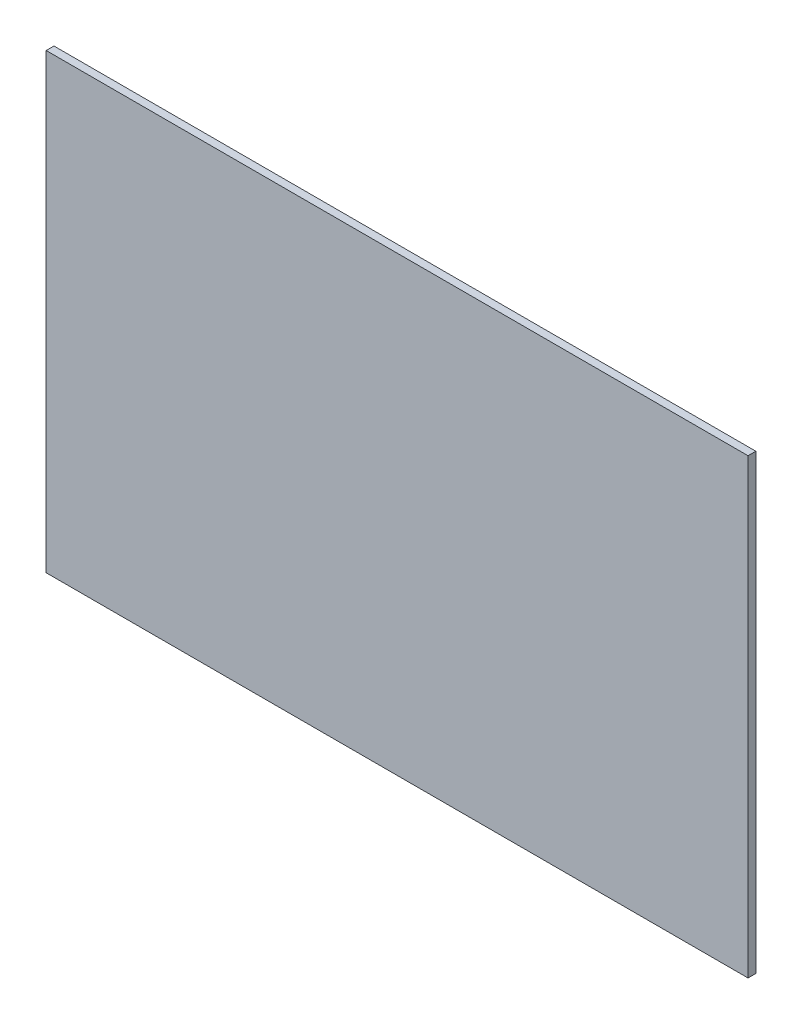
ISO-10303-21;
HEADER;
FILE_DESCRIPTION(('STEP AP214'),'2;1');
FILE_NAME('part.step','',(''),(''),'','','');
FILE_SCHEMA(('AUTOMOTIVE_DESIGN { 1 0 10303 214 1 1 1 1 }'));
ENDSEC;
DATA;
#1=APPLICATION_CONTEXT('core data for automotive mechanical design processes');
#2=APPLICATION_PROTOCOL_DEFINITION('international standard','automotive_design',2000,#1);
#3=PRODUCT_CONTEXT('',#1,'mechanical');
#4=PRODUCT('Part','Part','',(#3));
#5=PRODUCT_RELATED_PRODUCT_CATEGORY('part','',(#4));
#6=PRODUCT_DEFINITION_FORMATION('','',#4);
#7=PRODUCT_DEFINITION_CONTEXT('part definition',#1,'design');
#8=PRODUCT_DEFINITION('design','',#6,#7);
#9=PRODUCT_DEFINITION_SHAPE('','',#8);
#10=(LENGTH_UNIT() NAMED_UNIT(*) SI_UNIT(.MILLI.,.METRE.));
#11=(NAMED_UNIT(*) PLANE_ANGLE_UNIT() SI_UNIT($,.RADIAN.));
#12=(NAMED_UNIT(*) SI_UNIT($,.STERADIAN.) SOLID_ANGLE_UNIT());
#13=UNCERTAINTY_MEASURE_WITH_UNIT(LENGTH_MEASURE(1.E-05),#10,'distance_accuracy_value','');
#14=(GEOMETRIC_REPRESENTATION_CONTEXT(3) GLOBAL_UNCERTAINTY_ASSIGNED_CONTEXT((#13)) GLOBAL_UNIT_ASSIGNED_CONTEXT((#10,
#11,#12)) REPRESENTATION_CONTEXT('',''));
#15=CARTESIAN_POINT('',(0.,0.,0.));
#16=DIRECTION('',(0.,0.,1.));
#17=DIRECTION('',(1.,0.,0.));
#18=AXIS2_PLACEMENT_3D('',#15,#16,#17);
#19=CARTESIAN_POINT('',(285.75,184.15,6.35));
#20=DIRECTION('',(-1.,0.,0.));
#21=DIRECTION('',(0.,-1.,0.));
#22=AXIS2_PLACEMENT_3D('',#19,#20,#21);
#23=PLANE('',#22);
#24=DIRECTION('',(0.,1.,0.));
#25=VECTOR('',#24,1.);
#26=CARTESIAN_POINT('',(285.75,184.15,0.));
#27=LINE('',#26,#25);
#28=CARTESIAN_POINT('',(285.75,-184.15,0.));
#29=VERTEX_POINT('',#28);
#30=CARTESIAN_POINT('',(285.75,184.15,0.));
#31=VERTEX_POINT('',#30);
#32=EDGE_CURVE('E96',#29,#31,#27,.T.);
#33=ORIENTED_EDGE('',*,*,#32,.T.);
#34=DIRECTION('',(0.,0.,-1.));
#35=VECTOR('',#34,1.);
#36=CARTESIAN_POINT('',(285.75,184.15,6.35));
#37=LINE('',#36,#35);
#38=CARTESIAN_POINT('',(285.75,184.15,6.35));
#39=VERTEX_POINT('',#38);
#40=EDGE_CURVE('E11',#39,#31,#37,.T.);
#41=ORIENTED_EDGE('',*,*,#40,.F.);
#42=DIRECTION('',(0.,1.,0.));
#43=VECTOR('',#42,1.);
#44=CARTESIAN_POINT('',(285.75,184.15,6.35));
#45=LINE('',#44,#43);
#46=CARTESIAN_POINT('',(285.75,-184.15,6.35));
#47=VERTEX_POINT('',#46);
#48=EDGE_CURVE('E84',#47,#39,#45,.T.);
#49=ORIENTED_EDGE('',*,*,#48,.F.);
#50=DIRECTION('',(0.,0.,-1.));
#51=VECTOR('',#50,1.);
#52=CARTESIAN_POINT('',(285.75,-184.15,6.35));
#53=LINE('',#52,#51);
#54=EDGE_CURVE('E92',#47,#29,#53,.T.);
#55=ORIENTED_EDGE('',*,*,#54,.T.);
#56=EDGE_LOOP('',(#33,#41,#49,#55));
#57=FACE_BOUND('',#56,.T.);
#58=ADVANCED_FACE('F33',(#57),#23,.F.);
#59=CARTESIAN_POINT('',(-285.75,184.15,6.35));
#60=DIRECTION('',(0.,-1.,0.));
#61=DIRECTION('',(0.,0.,-1.));
#62=AXIS2_PLACEMENT_3D('',#59,#60,#61);
#63=PLANE('',#62);
#64=DIRECTION('',(-1.,0.,0.));
#65=VECTOR('',#64,1.);
#66=CARTESIAN_POINT('',(-285.75,184.15,0.));
#67=LINE('',#66,#65);
#68=CARTESIAN_POINT('',(-285.75,184.15,0.));
#69=VERTEX_POINT('',#68);
#70=EDGE_CURVE('E88',#31,#69,#67,.T.);
#71=ORIENTED_EDGE('',*,*,#70,.T.);
#72=DIRECTION('',(0.,0.,-1.));
#73=VECTOR('',#72,1.);
#74=CARTESIAN_POINT('',(-285.75,184.15,6.35));
#75=LINE('',#74,#73);
#76=CARTESIAN_POINT('',(-285.75,184.15,6.35));
#77=VERTEX_POINT('',#76);
#78=EDGE_CURVE('E41',#77,#69,#75,.T.);
#79=ORIENTED_EDGE('',*,*,#78,.F.);
#80=DIRECTION('',(-1.,0.,0.));
#81=VECTOR('',#80,1.);
#82=CARTESIAN_POINT('',(-285.75,184.15,6.35));
#83=LINE('',#82,#81);
#84=EDGE_CURVE('E79',#39,#77,#83,.T.);
#85=ORIENTED_EDGE('',*,*,#84,.F.);
#86=ORIENTED_EDGE('',*,*,#40,.T.);
#87=EDGE_LOOP('',(#71,#79,#85,#86));
#88=FACE_BOUND('',#87,.T.);
#89=ADVANCED_FACE('F87',(#88),#63,.F.);
#90=CARTESIAN_POINT('',(-285.75,184.15,6.35));
#91=DIRECTION('',(1.,0.,0.));
#92=DIRECTION('',(0.,1.,0.));
#93=AXIS2_PLACEMENT_3D('',#90,#91,#92);
#94=PLANE('',#93);
#95=DIRECTION('',(0.,-1.,0.));
#96=VECTOR('',#95,1.);
#97=CARTESIAN_POINT('',(-285.75,184.15,0.));
#98=LINE('',#97,#96);
#99=CARTESIAN_POINT('',(-285.75,-184.15,0.));
#100=VERTEX_POINT('',#99);
#101=EDGE_CURVE('E66',#69,#100,#98,.T.);
#102=ORIENTED_EDGE('',*,*,#101,.T.);
#103=DIRECTION('',(0.,0.,-1.));
#104=VECTOR('',#103,1.);
#105=CARTESIAN_POINT('',(-285.75,-184.15,6.35));
#106=LINE('',#105,#104);
#107=CARTESIAN_POINT('',(-285.75,-184.15,6.35));
#108=VERTEX_POINT('',#107);
#109=EDGE_CURVE('E89',#108,#100,#106,.T.);
#110=ORIENTED_EDGE('',*,*,#109,.F.);
#111=DIRECTION('',(0.,-1.,0.));
#112=VECTOR('',#111,1.);
#113=CARTESIAN_POINT('',(-285.75,184.15,6.35));
#114=LINE('',#113,#112);
#115=EDGE_CURVE('E82',#77,#108,#114,.T.);
#116=ORIENTED_EDGE('',*,*,#115,.F.);
#117=ORIENTED_EDGE('',*,*,#78,.T.);
#118=EDGE_LOOP('',(#102,#110,#116,#117));
#119=FACE_BOUND('',#118,.T.);
#120=ADVANCED_FACE('F90',(#119),#94,.F.);
#121=CARTESIAN_POINT('',(-285.75,-184.15,6.35));
#122=DIRECTION('',(0.,1.,0.));
#123=DIRECTION('',(0.,0.,1.));
#124=AXIS2_PLACEMENT_3D('',#121,#122,#123);
#125=PLANE('',#124);
#126=DIRECTION('',(1.,0.,0.));
#127=VECTOR('',#126,1.);
#128=CARTESIAN_POINT('',(-285.75,-184.15,0.));
#129=LINE('',#128,#127);
#130=EDGE_CURVE('E72',#100,#29,#129,.T.);
#131=ORIENTED_EDGE('',*,*,#130,.T.);
#132=ORIENTED_EDGE('',*,*,#54,.F.);
#133=DIRECTION('',(1.,0.,0.));
#134=VECTOR('',#133,1.);
#135=CARTESIAN_POINT('',(-285.75,-184.15,6.35));
#136=LINE('',#135,#134);
#137=EDGE_CURVE('E49',#108,#47,#136,.T.);
#138=ORIENTED_EDGE('',*,*,#137,.F.);
#139=ORIENTED_EDGE('',*,*,#109,.T.);
#140=EDGE_LOOP('',(#131,#132,#138,#139));
#141=FACE_BOUND('',#140,.T.);
#142=ADVANCED_FACE('F103',(#141),#125,.F.);
#143=CARTESIAN_POINT('',(0.,0.,6.35));
#144=DIRECTION('',(0.,0.,1.));
#145=DIRECTION('',(1.,0.,0.));
#146=AXIS2_PLACEMENT_3D('',#143,#144,#145);
#147=PLANE('',#146);
#148=ORIENTED_EDGE('',*,*,#48,.T.);
#149=ORIENTED_EDGE('',*,*,#84,.T.);
#150=ORIENTED_EDGE('',*,*,#115,.T.);
#151=ORIENTED_EDGE('',*,*,#137,.T.);
#152=EDGE_LOOP('',(#148,#149,#150,#151));
#153=FACE_BOUND('',#152,.T.);
#154=ADVANCED_FACE('F80',(#153),#147,.T.);
#155=CARTESIAN_POINT('',(0.,0.,0.));
#156=DIRECTION('',(0.,0.,1.));
#157=DIRECTION('',(1.,0.,0.));
#158=AXIS2_PLACEMENT_3D('',#155,#156,#157);
#159=PLANE('',#158);
#160=ORIENTED_EDGE('',*,*,#32,.F.);
#161=ORIENTED_EDGE('',*,*,#130,.F.);
#162=ORIENTED_EDGE('',*,*,#101,.F.);
#163=ORIENTED_EDGE('',*,*,#70,.F.);
#164=EDGE_LOOP('',(#160,#161,#162,#163));
#165=FACE_BOUND('',#164,.T.);
#166=ADVANCED_FACE('F106',(#165),#159,.F.);
#167=CLOSED_SHELL('',(#58,#89,#120,#142,#154,#166));
#168=MANIFOLD_SOLID_BREP('B2',#167);
#169=ADVANCED_BREP_SHAPE_REPRESENTATION('',(#18,#168),#14);
#170=SHAPE_DEFINITION_REPRESENTATION(#9,#169);
ENDSEC;
END-ISO-10303-21;
